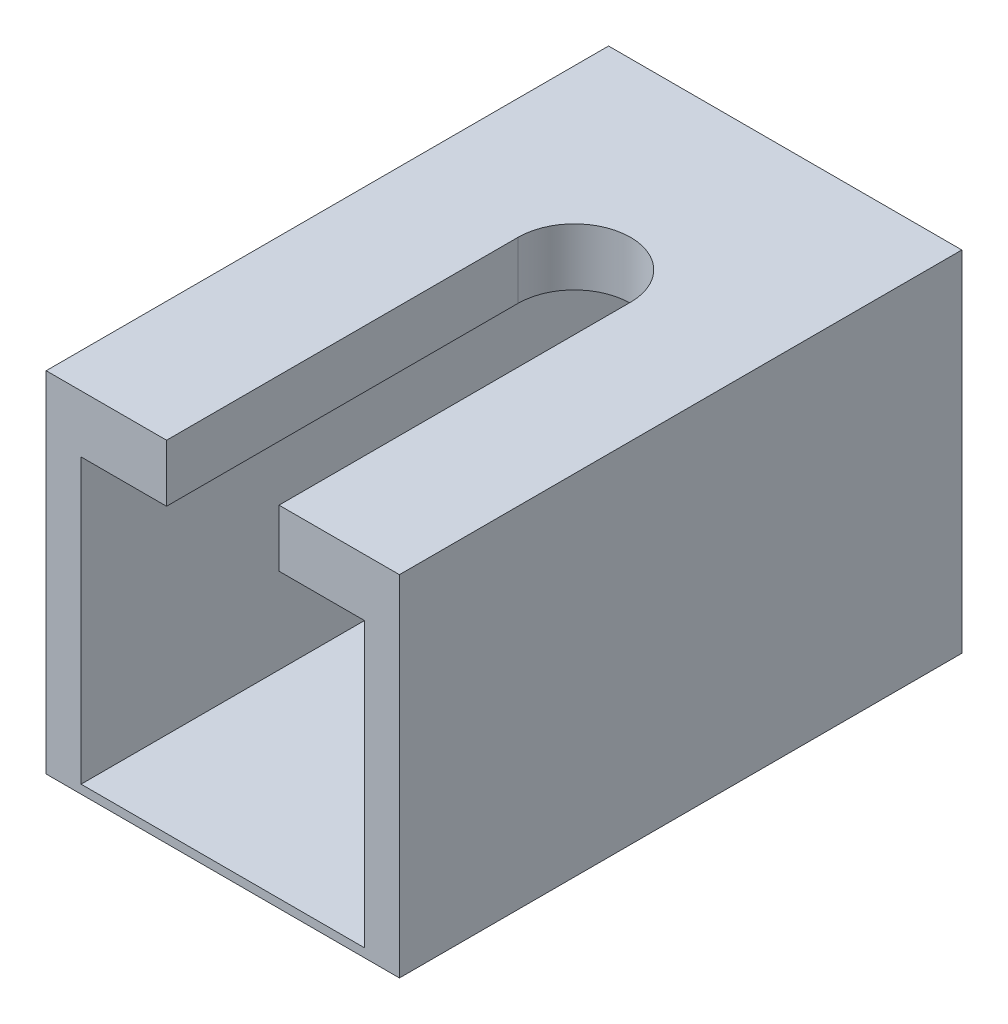
ISO-10303-21;
HEADER;
FILE_DESCRIPTION(('STEP AP214'),'2;1');
FILE_NAME('part.step','',(''),(''),'','','');
FILE_SCHEMA(('AUTOMOTIVE_DESIGN { 1 0 10303 214 1 1 1 1 }'));
ENDSEC;
DATA;
#1=APPLICATION_CONTEXT('core data for automotive mechanical design processes');
#2=APPLICATION_PROTOCOL_DEFINITION('international standard','automotive_design',2000,#1);
#3=PRODUCT_CONTEXT('',#1,'mechanical');
#4=PRODUCT('Part','Part','',(#3));
#5=PRODUCT_RELATED_PRODUCT_CATEGORY('part','',(#4));
#6=PRODUCT_DEFINITION_FORMATION('','',#4);
#7=PRODUCT_DEFINITION_CONTEXT('part definition',#1,'design');
#8=PRODUCT_DEFINITION('design','',#6,#7);
#9=PRODUCT_DEFINITION_SHAPE('','',#8);
#10=(LENGTH_UNIT() NAMED_UNIT(*) SI_UNIT(.MILLI.,.METRE.));
#11=(NAMED_UNIT(*) PLANE_ANGLE_UNIT() SI_UNIT($,.RADIAN.));
#12=(NAMED_UNIT(*) SI_UNIT($,.STERADIAN.) SOLID_ANGLE_UNIT());
#13=UNCERTAINTY_MEASURE_WITH_UNIT(LENGTH_MEASURE(1.E-05),#10,'distance_accuracy_value','');
#14=(GEOMETRIC_REPRESENTATION_CONTEXT(3) GLOBAL_UNCERTAINTY_ASSIGNED_CONTEXT((#13)) GLOBAL_UNIT_ASSIGNED_CONTEXT((#10,
#11,#12)) REPRESENTATION_CONTEXT('',''));
#15=CARTESIAN_POINT('',(0.,0.,0.));
#16=DIRECTION('',(0.,0.,1.));
#17=DIRECTION('',(1.,0.,0.));
#18=AXIS2_PLACEMENT_3D('',#15,#16,#17);
#19=CARTESIAN_POINT('',(0.,0.,12.7));
#20=DIRECTION('',(0.,0.,1.));
#21=DIRECTION('',(1.,0.,0.));
#22=AXIS2_PLACEMENT_3D('',#19,#20,#21);
#23=PLANE('',#22);
#24=DIRECTION('',(0.,1.,0.));
#25=VECTOR('',#24,1.);
#26=CARTESIAN_POINT('',(-2.54,-3.71649,12.7));
#27=LINE('',#26,#25);
#28=CARTESIAN_POINT('',(-2.54,6.4,12.7));
#29=VERTEX_POINT('',#28);
#30=CARTESIAN_POINT('',(-2.54,8.98351,12.7));
#31=VERTEX_POINT('',#30);
#32=EDGE_CURVE('E202',#29,#31,#27,.T.);
#33=ORIENTED_EDGE('',*,*,#32,.T.);
#34=DIRECTION('',(-1.,0.,0.));
#35=VECTOR('',#34,1.);
#36=CARTESIAN_POINT('',(-7.97750002,8.98351,12.7));
#37=LINE('',#36,#35);
#38=CARTESIAN_POINT('',(-7.97750002,8.98351,12.7));
#39=VERTEX_POINT('',#38);
#40=EDGE_CURVE('E147',#31,#39,#37,.T.);
#41=ORIENTED_EDGE('',*,*,#40,.T.);
#42=DIRECTION('',(0.,-1.,0.));
#43=VECTOR('',#42,1.);
#44=CARTESIAN_POINT('',(-7.97750002,8.98351,12.7));
#45=LINE('',#44,#43);
#46=CARTESIAN_POINT('',(-7.97750002,-6.792125,12.7));
#47=VERTEX_POINT('',#46);
#48=EDGE_CURVE('E146',#39,#47,#45,.T.);
#49=ORIENTED_EDGE('',*,*,#48,.T.);
#50=DIRECTION('',(1.,0.,0.));
#51=VECTOR('',#50,1.);
#52=CARTESIAN_POINT('',(-7.97750002,-6.792125,12.7));
#53=LINE('',#52,#51);
#54=CARTESIAN_POINT('',(7.97750002000001,-6.792125,12.7));
#55=VERTEX_POINT('',#54);
#56=EDGE_CURVE('E149',#47,#55,#53,.T.);
#57=ORIENTED_EDGE('',*,*,#56,.T.);
#58=DIRECTION('',(0.,1.,0.));
#59=VECTOR('',#58,1.);
#60=CARTESIAN_POINT('',(7.97750002,8.98351,12.7));
#61=LINE('',#60,#59);
#62=CARTESIAN_POINT('',(7.97750002,8.98351,12.7));
#63=VERTEX_POINT('',#62);
#64=EDGE_CURVE('E144',#55,#63,#61,.T.);
#65=ORIENTED_EDGE('',*,*,#64,.T.);
#66=CARTESIAN_POINT('',(2.54,8.98351,12.7));
#67=VERTEX_POINT('',#66);
#68=EDGE_CURVE('E136',#63,#67,#37,.T.);
#69=ORIENTED_EDGE('',*,*,#68,.T.);
#70=DIRECTION('',(0.,1.,0.));
#71=VECTOR('',#70,1.);
#72=CARTESIAN_POINT('',(2.54,-3.71649,12.7));
#73=LINE('',#72,#71);
#74=CARTESIAN_POINT('',(2.54,6.4,12.7));
#75=VERTEX_POINT('',#74);
#76=EDGE_CURVE('E119',#75,#67,#73,.T.);
#77=ORIENTED_EDGE('',*,*,#76,.F.);
#78=DIRECTION('',(-1.,0.,0.));
#79=VECTOR('',#78,1.);
#80=CARTESIAN_POINT('',(-6.4,6.4,12.7));
#81=LINE('',#80,#79);
#82=CARTESIAN_POINT('',(6.4,6.4,12.7));
#83=VERTEX_POINT('',#82);
#84=EDGE_CURVE('E185',#83,#75,#81,.T.);
#85=ORIENTED_EDGE('',*,*,#84,.F.);
#86=DIRECTION('',(0.,1.,0.));
#87=VECTOR('',#86,1.);
#88=CARTESIAN_POINT('',(6.4,6.4,12.7));
#89=LINE('',#88,#87);
#90=CARTESIAN_POINT('',(6.4,-6.4,12.7));
#91=VERTEX_POINT('',#90);
#92=EDGE_CURVE('E193',#91,#83,#89,.T.);
#93=ORIENTED_EDGE('',*,*,#92,.F.);
#94=DIRECTION('',(1.,0.,0.));
#95=VECTOR('',#94,1.);
#96=CARTESIAN_POINT('',(-6.4,-6.4,12.7));
#97=LINE('',#96,#95);
#98=CARTESIAN_POINT('',(-6.4,-6.4,12.7));
#99=VERTEX_POINT('',#98);
#100=EDGE_CURVE('E191',#99,#91,#97,.T.);
#101=ORIENTED_EDGE('',*,*,#100,.F.);
#102=DIRECTION('',(0.,-1.,0.));
#103=VECTOR('',#102,1.);
#104=CARTESIAN_POINT('',(-6.4,6.4,12.7));
#105=LINE('',#104,#103);
#106=CARTESIAN_POINT('',(-6.4,6.4,12.7));
#107=VERTEX_POINT('',#106);
#108=EDGE_CURVE('E188',#107,#99,#105,.T.);
#109=ORIENTED_EDGE('',*,*,#108,.F.);
#110=EDGE_CURVE('E189',#29,#107,#81,.T.);
#111=ORIENTED_EDGE('',*,*,#110,.F.);
#112=EDGE_LOOP('',(#33,#41,#49,#57,#65,#69,#77,#85,#93,#101,#109,#111));
#113=FACE_BOUND('',#112,.T.);
#114=ADVANCED_FACE('F33',(#113),#23,.T.);
#115=CARTESIAN_POINT('',(0.,0.,-12.7));
#116=DIRECTION('',(0.,0.,1.));
#117=DIRECTION('',(1.,0.,0.));
#118=AXIS2_PLACEMENT_3D('',#115,#116,#117);
#119=PLANE('',#118);
#120=DIRECTION('',(0.,1.,0.));
#121=VECTOR('',#120,1.);
#122=CARTESIAN_POINT('',(7.97750002,8.98351,-12.7));
#123=LINE('',#122,#121);
#124=CARTESIAN_POINT('',(7.97750002000001,-6.792125,-12.7));
#125=VERTEX_POINT('',#124);
#126=CARTESIAN_POINT('',(7.97750002,8.98351,-12.7));
#127=VERTEX_POINT('',#126);
#128=EDGE_CURVE('E156',#125,#127,#123,.T.);
#129=ORIENTED_EDGE('',*,*,#128,.F.);
#130=DIRECTION('',(1.,0.,0.));
#131=VECTOR('',#130,1.);
#132=CARTESIAN_POINT('',(-7.97750002,-6.792125,-12.7));
#133=LINE('',#132,#131);
#134=CARTESIAN_POINT('',(-7.97750002,-6.792125,-12.7));
#135=VERTEX_POINT('',#134);
#136=EDGE_CURVE('E164',#135,#125,#133,.T.);
#137=ORIENTED_EDGE('',*,*,#136,.F.);
#138=DIRECTION('',(0.,-1.,0.));
#139=VECTOR('',#138,1.);
#140=CARTESIAN_POINT('',(-7.97750002,8.98351,-12.7));
#141=LINE('',#140,#139);
#142=CARTESIAN_POINT('',(-7.97750002,8.98351,-12.7));
#143=VERTEX_POINT('',#142);
#144=EDGE_CURVE('E162',#143,#135,#141,.T.);
#145=ORIENTED_EDGE('',*,*,#144,.F.);
#146=DIRECTION('',(-1.,0.,0.));
#147=VECTOR('',#146,1.);
#148=CARTESIAN_POINT('',(-7.97750002,8.98351,-12.7));
#149=LINE('',#148,#147);
#150=EDGE_CURVE('E159',#127,#143,#149,.T.);
#151=ORIENTED_EDGE('',*,*,#150,.F.);
#152=EDGE_LOOP('',(#129,#137,#145,#151));
#153=FACE_BOUND('',#152,.T.);
#154=DIRECTION('',(0.,1.,0.));
#155=VECTOR('',#154,1.);
#156=CARTESIAN_POINT('',(6.4,6.4,-12.7));
#157=LINE('',#156,#155);
#158=CARTESIAN_POINT('',(6.4,-6.4,-12.7));
#159=VERTEX_POINT('',#158);
#160=CARTESIAN_POINT('',(6.4,6.4,-12.7));
#161=VERTEX_POINT('',#160);
#162=EDGE_CURVE('E198',#159,#161,#157,.T.);
#163=ORIENTED_EDGE('',*,*,#162,.T.);
#164=DIRECTION('',(-1.,0.,0.));
#165=VECTOR('',#164,1.);
#166=CARTESIAN_POINT('',(-6.4,6.4,-12.7));
#167=LINE('',#166,#165);
#168=CARTESIAN_POINT('',(-6.4,6.4,-12.7));
#169=VERTEX_POINT('',#168);
#170=EDGE_CURVE('E201',#161,#169,#167,.T.);
#171=ORIENTED_EDGE('',*,*,#170,.T.);
#172=DIRECTION('',(0.,-1.,0.));
#173=VECTOR('',#172,1.);
#174=CARTESIAN_POINT('',(-6.4,6.4,-12.7));
#175=LINE('',#174,#173);
#176=CARTESIAN_POINT('',(-6.4,-6.4,-12.7));
#177=VERTEX_POINT('',#176);
#178=EDGE_CURVE('E205',#169,#177,#175,.T.);
#179=ORIENTED_EDGE('',*,*,#178,.T.);
#180=DIRECTION('',(1.,0.,0.));
#181=VECTOR('',#180,1.);
#182=CARTESIAN_POINT('',(-6.4,-6.4,-12.7));
#183=LINE('',#182,#181);
#184=EDGE_CURVE('E208',#177,#159,#183,.T.);
#185=ORIENTED_EDGE('',*,*,#184,.T.);
#186=EDGE_LOOP('',(#163,#171,#179,#185));
#187=FACE_BOUND('',#186,.T.);
#188=ADVANCED_FACE('F219',(#153,#187),#119,.F.);
#189=CARTESIAN_POINT('',(7.97750002,8.98351,12.7));
#190=DIRECTION('',(-1.,0.,0.));
#191=DIRECTION('',(0.,-1.,0.));
#192=AXIS2_PLACEMENT_3D('',#189,#190,#191);
#193=PLANE('',#192);
#194=ORIENTED_EDGE('',*,*,#128,.T.);
#195=DIRECTION('',(0.,0.,-1.));
#196=VECTOR('',#195,1.);
#197=CARTESIAN_POINT('',(7.97750002,8.98351,12.7));
#198=LINE('',#197,#196);
#199=EDGE_CURVE('E174',#63,#127,#198,.T.);
#200=ORIENTED_EDGE('',*,*,#199,.F.);
#201=ORIENTED_EDGE('',*,*,#64,.F.);
#202=DIRECTION('',(0.,0.,-1.));
#203=VECTOR('',#202,1.);
#204=CARTESIAN_POINT('',(7.97750002000001,-6.792125,12.7));
#205=LINE('',#204,#203);
#206=EDGE_CURVE('E155',#55,#125,#205,.T.);
#207=ORIENTED_EDGE('',*,*,#206,.T.);
#208=EDGE_LOOP('',(#194,#200,#201,#207));
#209=FACE_BOUND('',#208,.T.);
#210=ADVANCED_FACE('F35',(#209),#193,.F.);
#211=CARTESIAN_POINT('',(-7.97750002,8.98351,12.7));
#212=DIRECTION('',(0.,-1.,0.));
#213=DIRECTION('',(1.,0.,0.));
#214=AXIS2_PLACEMENT_3D('',#211,#212,#213);
#215=PLANE('',#214);
#216=ORIENTED_EDGE('',*,*,#40,.F.);
#217=DIRECTION('',(0.,0.,1.));
#218=VECTOR('',#217,1.);
#219=CARTESIAN_POINT('',(-2.54,8.98351,12.7));
#220=LINE('',#219,#218);
#221=CARTESIAN_POINT('',(-2.54,8.98351,-3.175));
#222=VERTEX_POINT('',#221);
#223=EDGE_CURVE('E130',#222,#31,#220,.T.);
#224=ORIENTED_EDGE('',*,*,#223,.F.);
#225=CARTESIAN_POINT('',(0.,8.98351,-3.175));
#226=DIRECTION('',(0.,1.,0.));
#227=DIRECTION('',(-1.,0.,0.));
#228=AXIS2_PLACEMENT_3D('',#225,#226,#227);
#229=CIRCLE('',#228,2.54);
#230=CARTESIAN_POINT('',(2.54,8.98351,-3.175));
#231=VERTEX_POINT('',#230);
#232=EDGE_CURVE('E140',#231,#222,#229,.T.);
#233=ORIENTED_EDGE('',*,*,#232,.F.);
#234=DIRECTION('',(0.,0.,-1.));
#235=VECTOR('',#234,1.);
#236=CARTESIAN_POINT('',(2.54,8.98351,-3.175));
#237=LINE('',#236,#235);
#238=EDGE_CURVE('E122',#67,#231,#237,.T.);
#239=ORIENTED_EDGE('',*,*,#238,.F.);
#240=ORIENTED_EDGE('',*,*,#68,.F.);
#241=ORIENTED_EDGE('',*,*,#199,.T.);
#242=ORIENTED_EDGE('',*,*,#150,.T.);
#243=DIRECTION('',(0.,0.,-1.));
#244=VECTOR('',#243,1.);
#245=CARTESIAN_POINT('',(-7.97750002,8.98351,12.7));
#246=LINE('',#245,#244);
#247=EDGE_CURVE('E171',#39,#143,#246,.T.);
#248=ORIENTED_EDGE('',*,*,#247,.F.);
#249=EDGE_LOOP('',(#216,#224,#233,#239,#240,#241,#242,#248));
#250=FACE_BOUND('',#249,.T.);
#251=ADVANCED_FACE('F134',(#250),#215,.F.);
#252=CARTESIAN_POINT('',(-7.97750002,8.98351,12.7));
#253=DIRECTION('',(1.,0.,0.));
#254=DIRECTION('',(0.,1.,0.));
#255=AXIS2_PLACEMENT_3D('',#252,#253,#254);
#256=PLANE('',#255);
#257=ORIENTED_EDGE('',*,*,#144,.T.);
#258=DIRECTION('',(0.,0.,-1.));
#259=VECTOR('',#258,1.);
#260=CARTESIAN_POINT('',(-7.97750002,-6.792125,12.7));
#261=LINE('',#260,#259);
#262=EDGE_CURVE('E168',#47,#135,#261,.T.);
#263=ORIENTED_EDGE('',*,*,#262,.F.);
#264=ORIENTED_EDGE('',*,*,#48,.F.);
#265=ORIENTED_EDGE('',*,*,#247,.T.);
#266=EDGE_LOOP('',(#257,#263,#264,#265));
#267=FACE_BOUND('',#266,.T.);
#268=ADVANCED_FACE('F241',(#267),#256,.F.);
#269=CARTESIAN_POINT('',(-7.97750002,-6.792125,12.7));
#270=DIRECTION('',(0.,1.,0.));
#271=DIRECTION('',(0.,0.,1.));
#272=AXIS2_PLACEMENT_3D('',#269,#270,#271);
#273=PLANE('',#272);
#274=ORIENTED_EDGE('',*,*,#136,.T.);
#275=ORIENTED_EDGE('',*,*,#206,.F.);
#276=ORIENTED_EDGE('',*,*,#56,.F.);
#277=ORIENTED_EDGE('',*,*,#262,.T.);
#278=EDGE_LOOP('',(#274,#275,#276,#277));
#279=FACE_BOUND('',#278,.T.);
#280=ADVANCED_FACE('F245',(#279),#273,.F.);
#281=CARTESIAN_POINT('',(6.4,6.4,12.7));
#282=DIRECTION('',(-1.,0.,0.));
#283=DIRECTION('',(0.,-1.,0.));
#284=AXIS2_PLACEMENT_3D('',#281,#282,#283);
#285=PLANE('',#284);
#286=ORIENTED_EDGE('',*,*,#162,.F.);
#287=DIRECTION('',(0.,0.,-1.));
#288=VECTOR('',#287,1.);
#289=CARTESIAN_POINT('',(6.4,-6.4,12.7));
#290=LINE('',#289,#288);
#291=EDGE_CURVE('E197',#91,#159,#290,.T.);
#292=ORIENTED_EDGE('',*,*,#291,.F.);
#293=ORIENTED_EDGE('',*,*,#92,.T.);
#294=DIRECTION('',(0.,0.,-1.));
#295=VECTOR('',#294,1.);
#296=CARTESIAN_POINT('',(6.4,6.4,12.7));
#297=LINE('',#296,#295);
#298=EDGE_CURVE('E160',#83,#161,#297,.T.);
#299=ORIENTED_EDGE('',*,*,#298,.T.);
#300=EDGE_LOOP('',(#286,#292,#293,#299));
#301=FACE_BOUND('',#300,.T.);
#302=ADVANCED_FACE('F216',(#301),#285,.T.);
#303=CARTESIAN_POINT('',(-6.4,6.4,12.7));
#304=DIRECTION('',(0.,-1.,0.));
#305=DIRECTION('',(0.,0.,-1.));
#306=AXIS2_PLACEMENT_3D('',#303,#304,#305);
#307=PLANE('',#306);
#308=DIRECTION('',(0.,0.,-1.));
#309=VECTOR('',#308,1.);
#310=CARTESIAN_POINT('',(-2.54,6.4,12.7));
#311=LINE('',#310,#309);
#312=CARTESIAN_POINT('',(-2.54,6.4,-3.175));
#313=VERTEX_POINT('',#312);
#314=EDGE_CURVE('E11',#29,#313,#311,.T.);
#315=ORIENTED_EDGE('',*,*,#314,.F.);
#316=ORIENTED_EDGE('',*,*,#110,.T.);
#317=DIRECTION('',(0.,0.,-1.));
#318=VECTOR('',#317,1.);
#319=CARTESIAN_POINT('',(-6.4,6.4,12.7));
#320=LINE('',#319,#318);
#321=EDGE_CURVE('E214',#107,#169,#320,.T.);
#322=ORIENTED_EDGE('',*,*,#321,.T.);
#323=ORIENTED_EDGE('',*,*,#170,.F.);
#324=ORIENTED_EDGE('',*,*,#298,.F.);
#325=ORIENTED_EDGE('',*,*,#84,.T.);
#326=DIRECTION('',(0.,0.,1.));
#327=VECTOR('',#326,1.);
#328=CARTESIAN_POINT('',(2.54,6.4,12.7));
#329=LINE('',#328,#327);
#330=CARTESIAN_POINT('',(2.54,6.4,-3.175));
#331=VERTEX_POINT('',#330);
#332=EDGE_CURVE('E125',#331,#75,#329,.T.);
#333=ORIENTED_EDGE('',*,*,#332,.F.);
#334=CARTESIAN_POINT('',(0.,6.4,-3.175));
#335=DIRECTION('',(0.,-1.,0.));
#336=DIRECTION('',(0.,0.,-1.));
#337=AXIS2_PLACEMENT_3D('',#334,#335,#336);
#338=CIRCLE('',#337,2.54);
#339=EDGE_CURVE('E41',#313,#331,#338,.T.);
#340=ORIENTED_EDGE('',*,*,#339,.F.);
#341=EDGE_LOOP('',(#315,#316,#322,#323,#324,#325,#333,#340));
#342=FACE_BOUND('',#341,.T.);
#343=ADVANCED_FACE('F183',(#342),#307,.T.);
#344=CARTESIAN_POINT('',(-6.4,6.4,12.7));
#345=DIRECTION('',(1.,0.,0.));
#346=DIRECTION('',(0.,1.,0.));
#347=AXIS2_PLACEMENT_3D('',#344,#345,#346);
#348=PLANE('',#347);
#349=ORIENTED_EDGE('',*,*,#178,.F.);
#350=ORIENTED_EDGE('',*,*,#321,.F.);
#351=ORIENTED_EDGE('',*,*,#108,.T.);
#352=DIRECTION('',(0.,0.,-1.));
#353=VECTOR('',#352,1.);
#354=CARTESIAN_POINT('',(-6.4,-6.4,12.7));
#355=LINE('',#354,#353);
#356=EDGE_CURVE('E56',#99,#177,#355,.T.);
#357=ORIENTED_EDGE('',*,*,#356,.T.);
#358=EDGE_LOOP('',(#349,#350,#351,#357));
#359=FACE_BOUND('',#358,.T.);
#360=ADVANCED_FACE('F227',(#359),#348,.T.);
#361=CARTESIAN_POINT('',(-6.4,-6.4,12.7));
#362=DIRECTION('',(0.,1.,0.));
#363=DIRECTION('',(0.,0.,1.));
#364=AXIS2_PLACEMENT_3D('',#361,#362,#363);
#365=PLANE('',#364);
#366=ORIENTED_EDGE('',*,*,#184,.F.);
#367=ORIENTED_EDGE('',*,*,#356,.F.);
#368=ORIENTED_EDGE('',*,*,#100,.T.);
#369=ORIENTED_EDGE('',*,*,#291,.T.);
#370=EDGE_LOOP('',(#366,#367,#368,#369));
#371=FACE_BOUND('',#370,.T.);
#372=ADVANCED_FACE('F221',(#371),#365,.T.);
#373=CARTESIAN_POINT('',(-2.54,-3.71649,12.7));
#374=DIRECTION('',(-1.,0.,0.));
#375=DIRECTION('',(0.,-1.,0.));
#376=AXIS2_PLACEMENT_3D('',#373,#374,#375);
#377=PLANE('',#376);
#378=ORIENTED_EDGE('',*,*,#314,.T.);
#379=DIRECTION('',(0.,1.,0.));
#380=VECTOR('',#379,1.);
#381=CARTESIAN_POINT('',(-2.54,-3.71649,-3.175));
#382=LINE('',#381,#380);
#383=EDGE_CURVE('E180',#313,#222,#382,.T.);
#384=ORIENTED_EDGE('',*,*,#383,.T.);
#385=ORIENTED_EDGE('',*,*,#223,.T.);
#386=ORIENTED_EDGE('',*,*,#32,.F.);
#387=EDGE_LOOP('',(#378,#384,#385,#386));
#388=FACE_BOUND('',#387,.T.);
#389=ADVANCED_FACE('F229',(#388),#377,.F.);
#390=CARTESIAN_POINT('',(0.,-3.71649,-3.175));
#391=DIRECTION('',(0.,1.,0.));
#392=DIRECTION('',(-1.,0.,0.));
#393=AXIS2_PLACEMENT_3D('',#390,#391,#392);
#394=CYLINDRICAL_SURFACE('',#393,2.54);
#395=ORIENTED_EDGE('',*,*,#339,.T.);
#396=DIRECTION('',(0.,1.,0.));
#397=VECTOR('',#396,1.);
#398=CARTESIAN_POINT('',(2.54,-3.71649,-3.175));
#399=LINE('',#398,#397);
#400=EDGE_CURVE('E48',#331,#231,#399,.T.);
#401=ORIENTED_EDGE('',*,*,#400,.T.);
#402=ORIENTED_EDGE('',*,*,#232,.T.);
#403=ORIENTED_EDGE('',*,*,#383,.F.);
#404=EDGE_LOOP('',(#395,#401,#402,#403));
#405=FACE_BOUND('',#404,.T.);
#406=ADVANCED_FACE('F179',(#405),#394,.F.);
#407=CARTESIAN_POINT('',(2.54,-3.71649,-3.175));
#408=DIRECTION('',(1.,0.,0.));
#409=DIRECTION('',(0.,0.,-1.));
#410=AXIS2_PLACEMENT_3D('',#407,#408,#409);
#411=PLANE('',#410);
#412=ORIENTED_EDGE('',*,*,#332,.T.);
#413=ORIENTED_EDGE('',*,*,#76,.T.);
#414=ORIENTED_EDGE('',*,*,#238,.T.);
#415=ORIENTED_EDGE('',*,*,#400,.F.);
#416=EDGE_LOOP('',(#412,#413,#414,#415));
#417=FACE_BOUND('',#416,.T.);
#418=ADVANCED_FACE('F121',(#417),#411,.F.);
#419=CLOSED_SHELL('',(#114,#188,#210,#251,#268,#280,#302,#343,#360,#372,#389,#406,#418));
#420=MANIFOLD_SOLID_BREP('B2',#419);
#421=ADVANCED_BREP_SHAPE_REPRESENTATION('',(#18,#420),#14);
#422=SHAPE_DEFINITION_REPRESENTATION(#9,#421);
ENDSEC;
END-ISO-10303-21;
